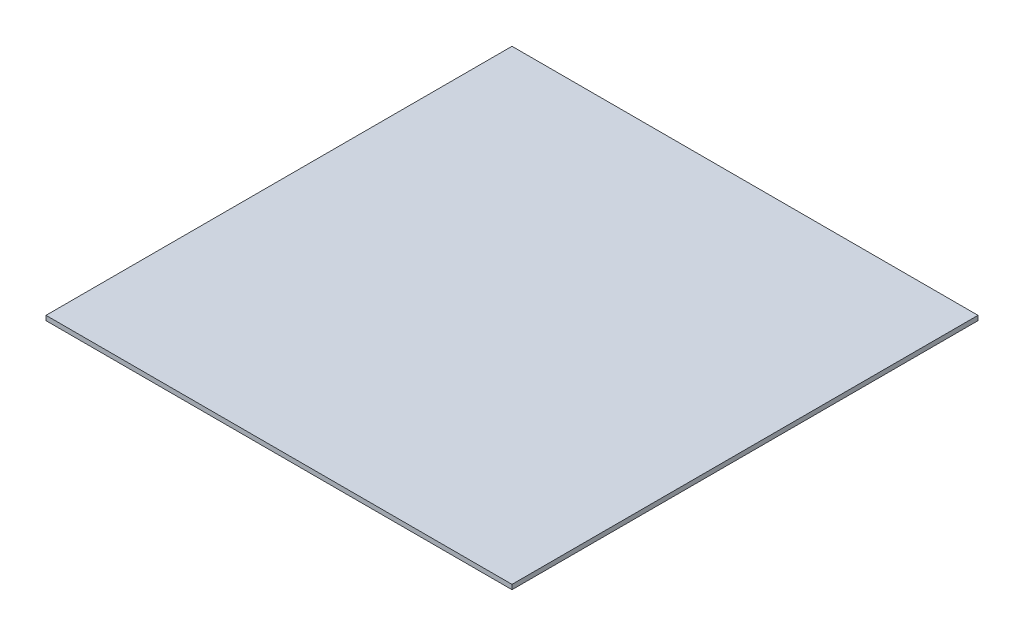
ISO-10303-21;
HEADER;
FILE_DESCRIPTION(('STEP AP214'),'2;1');
FILE_NAME('part.step','',(''),(''),'','','');
FILE_SCHEMA(('AUTOMOTIVE_DESIGN { 1 0 10303 214 1 1 1 1 }'));
ENDSEC;
DATA;
#1=APPLICATION_CONTEXT('core data for automotive mechanical design processes');
#2=APPLICATION_PROTOCOL_DEFINITION('international standard','automotive_design',2000,#1);
#3=PRODUCT_CONTEXT('',#1,'mechanical');
#4=PRODUCT('Part','Part','',(#3));
#5=PRODUCT_RELATED_PRODUCT_CATEGORY('part','',(#4));
#6=PRODUCT_DEFINITION_FORMATION('','',#4);
#7=PRODUCT_DEFINITION_CONTEXT('part definition',#1,'design');
#8=PRODUCT_DEFINITION('design','',#6,#7);
#9=PRODUCT_DEFINITION_SHAPE('','',#8);
#10=(LENGTH_UNIT() NAMED_UNIT(*) SI_UNIT(.MILLI.,.METRE.));
#11=(NAMED_UNIT(*) PLANE_ANGLE_UNIT() SI_UNIT($,.RADIAN.));
#12=(NAMED_UNIT(*) SI_UNIT($,.STERADIAN.) SOLID_ANGLE_UNIT());
#13=UNCERTAINTY_MEASURE_WITH_UNIT(LENGTH_MEASURE(1.E-05),#10,'distance_accuracy_value','');
#14=(GEOMETRIC_REPRESENTATION_CONTEXT(3) GLOBAL_UNCERTAINTY_ASSIGNED_CONTEXT((#13)) GLOBAL_UNIT_ASSIGNED_CONTEXT((#10,
#11,#12)) REPRESENTATION_CONTEXT('',''));
#15=CARTESIAN_POINT('',(0.,0.,0.));
#16=DIRECTION('',(0.,0.,1.));
#17=DIRECTION('',(1.,0.,0.));
#18=AXIS2_PLACEMENT_3D('',#15,#16,#17);
#19=CARTESIAN_POINT('',(50.,1.,50.));
#20=DIRECTION('',(-1.,0.,0.));
#21=DIRECTION('',(0.,0.,1.));
#22=AXIS2_PLACEMENT_3D('',#19,#20,#21);
#23=PLANE('',#22);
#24=DIRECTION('',(0.,0.,-1.));
#25=VECTOR('',#24,1.);
#26=CARTESIAN_POINT('',(50.,0.,50.));
#27=LINE('',#26,#25);
#28=CARTESIAN_POINT('',(50.,0.,50.));
#29=VERTEX_POINT('',#28);
#30=CARTESIAN_POINT('',(50.,0.,-50.));
#31=VERTEX_POINT('',#30);
#32=EDGE_CURVE('E96',#29,#31,#27,.T.);
#33=ORIENTED_EDGE('',*,*,#32,.T.);
#34=DIRECTION('',(0.,-1.,0.));
#35=VECTOR('',#34,1.);
#36=CARTESIAN_POINT('',(50.,1.,-50.));
#37=LINE('',#36,#35);
#38=CARTESIAN_POINT('',(50.,1.,-50.));
#39=VERTEX_POINT('',#38);
#40=EDGE_CURVE('E11',#39,#31,#37,.T.);
#41=ORIENTED_EDGE('',*,*,#40,.F.);
#42=DIRECTION('',(0.,0.,-1.));
#43=VECTOR('',#42,1.);
#44=CARTESIAN_POINT('',(50.,1.,50.));
#45=LINE('',#44,#43);
#46=CARTESIAN_POINT('',(50.,1.,50.));
#47=VERTEX_POINT('',#46);
#48=EDGE_CURVE('E84',#47,#39,#45,.T.);
#49=ORIENTED_EDGE('',*,*,#48,.F.);
#50=DIRECTION('',(0.,-1.,0.));
#51=VECTOR('',#50,1.);
#52=CARTESIAN_POINT('',(50.,1.,50.));
#53=LINE('',#52,#51);
#54=EDGE_CURVE('E92',#47,#29,#53,.T.);
#55=ORIENTED_EDGE('',*,*,#54,.T.);
#56=EDGE_LOOP('',(#33,#41,#49,#55));
#57=FACE_BOUND('',#56,.T.);
#58=ADVANCED_FACE('F33',(#57),#23,.F.);
#59=CARTESIAN_POINT('',(-50.,1.,-50.));
#60=DIRECTION('',(0.,0.,1.));
#61=DIRECTION('',(1.,0.,0.));
#62=AXIS2_PLACEMENT_3D('',#59,#60,#61);
#63=PLANE('',#62);
#64=DIRECTION('',(-1.,0.,0.));
#65=VECTOR('',#64,1.);
#66=CARTESIAN_POINT('',(-50.,0.,-50.));
#67=LINE('',#66,#65);
#68=CARTESIAN_POINT('',(-50.,0.,-50.));
#69=VERTEX_POINT('',#68);
#70=EDGE_CURVE('E88',#31,#69,#67,.T.);
#71=ORIENTED_EDGE('',*,*,#70,.T.);
#72=DIRECTION('',(0.,-1.,0.));
#73=VECTOR('',#72,1.);
#74=CARTESIAN_POINT('',(-50.,1.,-50.));
#75=LINE('',#74,#73);
#76=CARTESIAN_POINT('',(-50.,1.,-50.));
#77=VERTEX_POINT('',#76);
#78=EDGE_CURVE('E41',#77,#69,#75,.T.);
#79=ORIENTED_EDGE('',*,*,#78,.F.);
#80=DIRECTION('',(-1.,0.,0.));
#81=VECTOR('',#80,1.);
#82=CARTESIAN_POINT('',(-50.,1.,-50.));
#83=LINE('',#82,#81);
#84=EDGE_CURVE('E79',#39,#77,#83,.T.);
#85=ORIENTED_EDGE('',*,*,#84,.F.);
#86=ORIENTED_EDGE('',*,*,#40,.T.);
#87=EDGE_LOOP('',(#71,#79,#85,#86));
#88=FACE_BOUND('',#87,.T.);
#89=ADVANCED_FACE('F87',(#88),#63,.F.);
#90=CARTESIAN_POINT('',(-50.,1.,50.));
#91=DIRECTION('',(1.,0.,0.));
#92=DIRECTION('',(0.,0.,-1.));
#93=AXIS2_PLACEMENT_3D('',#90,#91,#92);
#94=PLANE('',#93);
#95=DIRECTION('',(0.,0.,1.));
#96=VECTOR('',#95,1.);
#97=CARTESIAN_POINT('',(-50.,0.,50.));
#98=LINE('',#97,#96);
#99=CARTESIAN_POINT('',(-50.,0.,50.));
#100=VERTEX_POINT('',#99);
#101=EDGE_CURVE('E66',#69,#100,#98,.T.);
#102=ORIENTED_EDGE('',*,*,#101,.T.);
#103=DIRECTION('',(0.,-1.,0.));
#104=VECTOR('',#103,1.);
#105=CARTESIAN_POINT('',(-50.,1.,50.));
#106=LINE('',#105,#104);
#107=CARTESIAN_POINT('',(-50.,1.,50.));
#108=VERTEX_POINT('',#107);
#109=EDGE_CURVE('E89',#108,#100,#106,.T.);
#110=ORIENTED_EDGE('',*,*,#109,.F.);
#111=DIRECTION('',(0.,0.,1.));
#112=VECTOR('',#111,1.);
#113=CARTESIAN_POINT('',(-50.,1.,50.));
#114=LINE('',#113,#112);
#115=EDGE_CURVE('E82',#77,#108,#114,.T.);
#116=ORIENTED_EDGE('',*,*,#115,.F.);
#117=ORIENTED_EDGE('',*,*,#78,.T.);
#118=EDGE_LOOP('',(#102,#110,#116,#117));
#119=FACE_BOUND('',#118,.T.);
#120=ADVANCED_FACE('F90',(#119),#94,.F.);
#121=CARTESIAN_POINT('',(-50.,1.,50.));
#122=DIRECTION('',(0.,0.,-1.));
#123=DIRECTION('',(-1.,0.,0.));
#124=AXIS2_PLACEMENT_3D('',#121,#122,#123);
#125=PLANE('',#124);
#126=DIRECTION('',(1.,0.,0.));
#127=VECTOR('',#126,1.);
#128=CARTESIAN_POINT('',(-50.,0.,50.));
#129=LINE('',#128,#127);
#130=EDGE_CURVE('E72',#100,#29,#129,.T.);
#131=ORIENTED_EDGE('',*,*,#130,.T.);
#132=ORIENTED_EDGE('',*,*,#54,.F.);
#133=DIRECTION('',(1.,0.,0.));
#134=VECTOR('',#133,1.);
#135=CARTESIAN_POINT('',(-50.,1.,50.));
#136=LINE('',#135,#134);
#137=EDGE_CURVE('E49',#108,#47,#136,.T.);
#138=ORIENTED_EDGE('',*,*,#137,.F.);
#139=ORIENTED_EDGE('',*,*,#109,.T.);
#140=EDGE_LOOP('',(#131,#132,#138,#139));
#141=FACE_BOUND('',#140,.T.);
#142=ADVANCED_FACE('F103',(#141),#125,.F.);
#143=CARTESIAN_POINT('',(0.,1.,0.));
#144=DIRECTION('',(0.,-1.,0.));
#145=DIRECTION('',(0.,0.,-1.));
#146=AXIS2_PLACEMENT_3D('',#143,#144,#145);
#147=PLANE('',#146);
#148=ORIENTED_EDGE('',*,*,#48,.T.);
#149=ORIENTED_EDGE('',*,*,#84,.T.);
#150=ORIENTED_EDGE('',*,*,#115,.T.);
#151=ORIENTED_EDGE('',*,*,#137,.T.);
#152=EDGE_LOOP('',(#148,#149,#150,#151));
#153=FACE_BOUND('',#152,.T.);
#154=ADVANCED_FACE('F80',(#153),#147,.F.);
#155=CARTESIAN_POINT('',(0.,0.,0.));
#156=DIRECTION('',(0.,-1.,0.));
#157=DIRECTION('',(0.,0.,-1.));
#158=AXIS2_PLACEMENT_3D('',#155,#156,#157);
#159=PLANE('',#158);
#160=ORIENTED_EDGE('',*,*,#32,.F.);
#161=ORIENTED_EDGE('',*,*,#130,.F.);
#162=ORIENTED_EDGE('',*,*,#101,.F.);
#163=ORIENTED_EDGE('',*,*,#70,.F.);
#164=EDGE_LOOP('',(#160,#161,#162,#163));
#165=FACE_BOUND('',#164,.T.);
#166=ADVANCED_FACE('F106',(#165),#159,.T.);
#167=CLOSED_SHELL('',(#58,#89,#120,#142,#154,#166));
#168=MANIFOLD_SOLID_BREP('B2',#167);
#169=ADVANCED_BREP_SHAPE_REPRESENTATION('',(#18,#168),#14);
#170=SHAPE_DEFINITION_REPRESENTATION(#9,#169);
ENDSEC;
END-ISO-10303-21;
